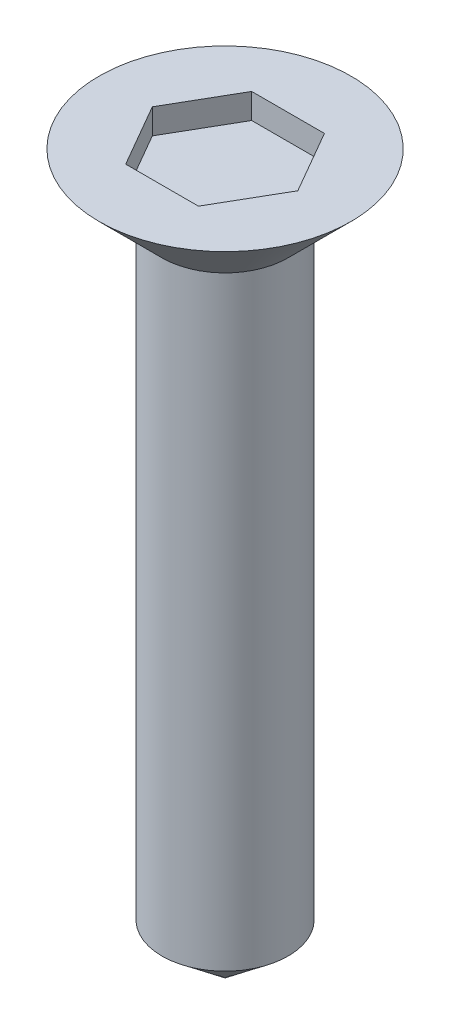
ISO-10303-21;
HEADER;
FILE_DESCRIPTION(('STEP AP214'),'2;1');
FILE_NAME('part.step','',(''),(''),'','','');
FILE_SCHEMA(('AUTOMOTIVE_DESIGN { 1 0 10303 214 1 1 1 1 }'));
ENDSEC;
DATA;
#1=APPLICATION_CONTEXT('core data for automotive mechanical design processes');
#2=APPLICATION_PROTOCOL_DEFINITION('international standard','automotive_design',2000,#1);
#3=PRODUCT_CONTEXT('',#1,'mechanical');
#4=PRODUCT('Part','Part','',(#3));
#5=PRODUCT_RELATED_PRODUCT_CATEGORY('part','',(#4));
#6=PRODUCT_DEFINITION_FORMATION('','',#4);
#7=PRODUCT_DEFINITION_CONTEXT('part definition',#1,'design');
#8=PRODUCT_DEFINITION('design','',#6,#7);
#9=PRODUCT_DEFINITION_SHAPE('','',#8);
#10=(LENGTH_UNIT() NAMED_UNIT(*) SI_UNIT(.MILLI.,.METRE.));
#11=(NAMED_UNIT(*) PLANE_ANGLE_UNIT() SI_UNIT($,.RADIAN.));
#12=(NAMED_UNIT(*) SI_UNIT($,.STERADIAN.) SOLID_ANGLE_UNIT());
#13=UNCERTAINTY_MEASURE_WITH_UNIT(LENGTH_MEASURE(1.E-05),#10,'distance_accuracy_value','');
#14=(GEOMETRIC_REPRESENTATION_CONTEXT(3) GLOBAL_UNCERTAINTY_ASSIGNED_CONTEXT((#13)) GLOBAL_UNIT_ASSIGNED_CONTEXT((#10,
#11,#12)) REPRESENTATION_CONTEXT('',''));
#15=CARTESIAN_POINT('',(0.,0.,0.));
#16=DIRECTION('',(0.,0.,1.));
#17=DIRECTION('',(1.,0.,0.));
#18=AXIS2_PLACEMENT_3D('',#15,#16,#17);
#19=CARTESIAN_POINT('',(0.,12.,0.));
#20=DIRECTION('',(0.,-1.,0.));
#21=DIRECTION('',(0.,0.,-1.));
#22=AXIS2_PLACEMENT_3D('',#19,#20,#21);
#23=CYLINDRICAL_SURFACE('',#22,1.25);
#24=CARTESIAN_POINT('',(0.,12.,0.));
#25=DIRECTION('',(0.,1.,0.));
#26=DIRECTION('',(0.,0.,1.));
#27=AXIS2_PLACEMENT_3D('',#24,#25,#26);
#28=CIRCLE('',#27,1.25);
#29=CARTESIAN_POINT('',(0.,12.,1.25));
#30=VERTEX_POINT('',#29);
#31=EDGE_CURVE('E11',#30,#30,#28,.T.);
#32=ORIENTED_EDGE('',*,*,#31,.F.);
#33=EDGE_LOOP('',(#32));
#34=FACE_BOUND('',#33,.T.);
#35=CARTESIAN_POINT('',(0.,0.,0.));
#36=DIRECTION('',(0.,1.,0.));
#37=DIRECTION('',(0.,0.,1.));
#38=AXIS2_PLACEMENT_3D('',#35,#36,#37);
#39=CIRCLE('',#38,1.25);
#40=CARTESIAN_POINT('',(0.,0.,1.25));
#41=VERTEX_POINT('',#40);
#42=EDGE_CURVE('E145',#41,#41,#39,.T.);
#43=ORIENTED_EDGE('',*,*,#42,.T.);
#44=EDGE_LOOP('',(#43));
#45=FACE_BOUND('',#44,.T.);
#46=ADVANCED_FACE('F47',(#34,#45),#23,.T.);
#47=CARTESIAN_POINT('',(0.,13.25,0.));
#48=DIRECTION('',(0.,-1.,0.));
#49=DIRECTION('',(0.,0.,-1.));
#50=AXIS2_PLACEMENT_3D('',#47,#48,#49);
#51=PLANE('',#50);
#52=DIRECTION('',(-0.5,0.,-0.866025403784439));
#53=VECTOR('',#52,1.);
#54=CARTESIAN_POINT('',(1.44337567297406,13.25,0.));
#55=LINE('',#54,#53);
#56=CARTESIAN_POINT('',(1.44337567297406,13.25,0.));
#57=VERTEX_POINT('',#56);
#58=CARTESIAN_POINT('',(0.721687836487032,13.25,-1.25));
#59=VERTEX_POINT('',#58);
#60=EDGE_CURVE('E144',#57,#59,#55,.T.);
#61=ORIENTED_EDGE('',*,*,#60,.F.);
#62=DIRECTION('',(0.5,0.,-0.866025403784439));
#63=VECTOR('',#62,1.);
#64=CARTESIAN_POINT('',(0.721687836487032,13.25,1.25));
#65=LINE('',#64,#63);
#66=CARTESIAN_POINT('',(0.721687836487032,13.25,1.25));
#67=VERTEX_POINT('',#66);
#68=EDGE_CURVE('E62',#67,#57,#65,.T.);
#69=ORIENTED_EDGE('',*,*,#68,.F.);
#70=DIRECTION('',(1.,0.,0.));
#71=VECTOR('',#70,1.);
#72=CARTESIAN_POINT('',(-0.721687836487033,13.25,1.25));
#73=LINE('',#72,#71);
#74=CARTESIAN_POINT('',(-0.721687836487033,13.25,1.25));
#75=VERTEX_POINT('',#74);
#76=EDGE_CURVE('E158',#75,#67,#73,.T.);
#77=ORIENTED_EDGE('',*,*,#76,.F.);
#78=DIRECTION('',(0.5,0.,0.866025403784439));
#79=VECTOR('',#78,1.);
#80=CARTESIAN_POINT('',(-1.44337567297407,13.25,0.));
#81=LINE('',#80,#79);
#82=CARTESIAN_POINT('',(-1.44337567297407,13.25,0.));
#83=VERTEX_POINT('',#82);
#84=EDGE_CURVE('E155',#83,#75,#81,.T.);
#85=ORIENTED_EDGE('',*,*,#84,.F.);
#86=DIRECTION('',(-0.5,0.,0.866025403784439));
#87=VECTOR('',#86,1.);
#88=CARTESIAN_POINT('',(-0.721687836487032,13.25,-1.25));
#89=LINE('',#88,#87);
#90=CARTESIAN_POINT('',(-0.721687836487032,13.25,-1.25));
#91=VERTEX_POINT('',#90);
#92=EDGE_CURVE('E112',#91,#83,#89,.T.);
#93=ORIENTED_EDGE('',*,*,#92,.F.);
#94=DIRECTION('',(-1.,0.,0.));
#95=VECTOR('',#94,1.);
#96=CARTESIAN_POINT('',(0.721687836487032,13.25,-1.25));
#97=LINE('',#96,#95);
#98=EDGE_CURVE('E149',#59,#91,#97,.T.);
#99=ORIENTED_EDGE('',*,*,#98,.F.);
#100=EDGE_LOOP('',(#61,#69,#77,#85,#93,#99));
#101=FACE_BOUND('',#100,.T.);
#102=CARTESIAN_POINT('',(0.,13.25,0.));
#103=DIRECTION('',(0.,1.,0.));
#104=DIRECTION('',(0.,0.,1.));
#105=AXIS2_PLACEMENT_3D('',#102,#103,#104);
#106=CIRCLE('',#105,2.5);
#107=CARTESIAN_POINT('',(0.,13.25,2.5));
#108=VERTEX_POINT('',#107);
#109=EDGE_CURVE('E55',#108,#108,#106,.T.);
#110=ORIENTED_EDGE('',*,*,#109,.T.);
#111=EDGE_LOOP('',(#110));
#112=FACE_BOUND('',#111,.T.);
#113=ADVANCED_FACE('F176',(#101,#112),#51,.F.);
#114=CARTESIAN_POINT('',(0.,12.,0.));
#115=DIRECTION('',(0.,1.,0.));
#116=DIRECTION('',(0.,0.,1.));
#117=AXIS2_PLACEMENT_3D('',#114,#115,#116);
#118=CONICAL_SURFACE('',#117,1.25,0.785398163397447);
#119=ORIENTED_EDGE('',*,*,#109,.F.);
#120=EDGE_LOOP('',(#119));
#121=FACE_BOUND('',#120,.T.);
#122=ORIENTED_EDGE('',*,*,#31,.T.);
#123=EDGE_LOOP('',(#122));
#124=FACE_BOUND('',#123,.T.);
#125=ADVANCED_FACE('F178',(#121,#124),#118,.T.);
#126=CARTESIAN_POINT('',(0.721687836487032,12.75,1.25));
#127=DIRECTION('',(0.866025403784439,0.,0.5));
#128=DIRECTION('',(0.5,0.,-0.866025403784439));
#129=AXIS2_PLACEMENT_3D('',#126,#127,#128);
#130=PLANE('',#129);
#131=ORIENTED_EDGE('',*,*,#68,.T.);
#132=DIRECTION('',(0.,1.,0.));
#133=VECTOR('',#132,1.);
#134=CARTESIAN_POINT('',(1.44337567297406,12.75,0.));
#135=LINE('',#134,#133);
#136=CARTESIAN_POINT('',(1.44337567297406,12.75,0.));
#137=VERTEX_POINT('',#136);
#138=EDGE_CURVE('E93',#137,#57,#135,.T.);
#139=ORIENTED_EDGE('',*,*,#138,.F.);
#140=DIRECTION('',(0.5,0.,-0.866025403784439));
#141=VECTOR('',#140,1.);
#142=CARTESIAN_POINT('',(0.721687836487032,12.75,1.25));
#143=LINE('',#142,#141);
#144=CARTESIAN_POINT('',(0.721687836487032,12.75,1.25));
#145=VERTEX_POINT('',#144);
#146=EDGE_CURVE('E161',#145,#137,#143,.T.);
#147=ORIENTED_EDGE('',*,*,#146,.F.);
#148=DIRECTION('',(0.,1.,0.));
#149=VECTOR('',#148,1.);
#150=CARTESIAN_POINT('',(0.721687836487032,12.75,1.25));
#151=LINE('',#150,#149);
#152=EDGE_CURVE('E70',#145,#67,#151,.T.);
#153=ORIENTED_EDGE('',*,*,#152,.T.);
#154=EDGE_LOOP('',(#131,#139,#147,#153));
#155=FACE_BOUND('',#154,.T.);
#156=ADVANCED_FACE('F181',(#155),#130,.F.);
#157=CARTESIAN_POINT('',(-0.721687836487033,12.75,1.25));
#158=DIRECTION('',(0.,0.,1.));
#159=DIRECTION('',(1.,0.,0.));
#160=AXIS2_PLACEMENT_3D('',#157,#158,#159);
#161=PLANE('',#160);
#162=ORIENTED_EDGE('',*,*,#76,.T.);
#163=ORIENTED_EDGE('',*,*,#152,.F.);
#164=DIRECTION('',(1.,0.,0.));
#165=VECTOR('',#164,1.);
#166=CARTESIAN_POINT('',(-0.721687836487033,12.75,1.25));
#167=LINE('',#166,#165);
#168=CARTESIAN_POINT('',(-0.721687836487033,12.75,1.25));
#169=VERTEX_POINT('',#168);
#170=EDGE_CURVE('E126',#169,#145,#167,.T.);
#171=ORIENTED_EDGE('',*,*,#170,.F.);
#172=DIRECTION('',(0.,1.,0.));
#173=VECTOR('',#172,1.);
#174=CARTESIAN_POINT('',(-0.721687836487033,12.75,1.25));
#175=LINE('',#174,#173);
#176=EDGE_CURVE('E117',#169,#75,#175,.T.);
#177=ORIENTED_EDGE('',*,*,#176,.T.);
#178=EDGE_LOOP('',(#162,#163,#171,#177));
#179=FACE_BOUND('',#178,.T.);
#180=ADVANCED_FACE('F203',(#179),#161,.F.);
#181=CARTESIAN_POINT('',(-1.44337567297407,12.75,0.));
#182=DIRECTION('',(-0.866025403784439,0.,0.5));
#183=DIRECTION('',(0.5,0.,0.866025403784439));
#184=AXIS2_PLACEMENT_3D('',#181,#182,#183);
#185=PLANE('',#184);
#186=ORIENTED_EDGE('',*,*,#84,.T.);
#187=ORIENTED_EDGE('',*,*,#176,.F.);
#188=DIRECTION('',(0.5,0.,0.866025403784439));
#189=VECTOR('',#188,1.);
#190=CARTESIAN_POINT('',(-1.44337567297407,12.75,0.));
#191=LINE('',#190,#189);
#192=CARTESIAN_POINT('',(-1.44337567297407,12.75,0.));
#193=VERTEX_POINT('',#192);
#194=EDGE_CURVE('E121',#193,#169,#191,.T.);
#195=ORIENTED_EDGE('',*,*,#194,.F.);
#196=DIRECTION('',(0.,1.,0.));
#197=VECTOR('',#196,1.);
#198=CARTESIAN_POINT('',(-1.44337567297407,12.75,0.));
#199=LINE('',#198,#197);
#200=EDGE_CURVE('E105',#193,#83,#199,.T.);
#201=ORIENTED_EDGE('',*,*,#200,.T.);
#202=EDGE_LOOP('',(#186,#187,#195,#201));
#203=FACE_BOUND('',#202,.T.);
#204=ADVANCED_FACE('F122',(#203),#185,.F.);
#205=CARTESIAN_POINT('',(-0.721687836487032,12.75,-1.25));
#206=DIRECTION('',(-0.866025403784438,0.,-0.5));
#207=DIRECTION('',(-0.5,0.,0.866025403784439));
#208=AXIS2_PLACEMENT_3D('',#205,#206,#207);
#209=PLANE('',#208);
#210=ORIENTED_EDGE('',*,*,#92,.T.);
#211=ORIENTED_EDGE('',*,*,#200,.F.);
#212=DIRECTION('',(-0.5,0.,0.866025403784439));
#213=VECTOR('',#212,1.);
#214=CARTESIAN_POINT('',(-0.721687836487032,12.75,-1.25));
#215=LINE('',#214,#213);
#216=CARTESIAN_POINT('',(-0.721687836487032,12.75,-1.25));
#217=VERTEX_POINT('',#216);
#218=EDGE_CURVE('E109',#217,#193,#215,.T.);
#219=ORIENTED_EDGE('',*,*,#218,.F.);
#220=DIRECTION('',(0.,1.,0.));
#221=VECTOR('',#220,1.);
#222=CARTESIAN_POINT('',(-0.721687836487032,12.75,-1.25));
#223=LINE('',#222,#221);
#224=EDGE_CURVE('E118',#217,#91,#223,.T.);
#225=ORIENTED_EDGE('',*,*,#224,.T.);
#226=EDGE_LOOP('',(#210,#211,#219,#225));
#227=FACE_BOUND('',#226,.T.);
#228=ADVANCED_FACE('F107',(#227),#209,.F.);
#229=CARTESIAN_POINT('',(0.721687836487032,12.75,-1.25));
#230=DIRECTION('',(0.,0.,-1.));
#231=DIRECTION('',(-1.,0.,0.));
#232=AXIS2_PLACEMENT_3D('',#229,#230,#231);
#233=PLANE('',#232);
#234=ORIENTED_EDGE('',*,*,#98,.T.);
#235=ORIENTED_EDGE('',*,*,#224,.F.);
#236=DIRECTION('',(-1.,0.,0.));
#237=VECTOR('',#236,1.);
#238=CARTESIAN_POINT('',(0.721687836487032,12.75,-1.25));
#239=LINE('',#238,#237);
#240=CARTESIAN_POINT('',(0.721687836487032,12.75,-1.25));
#241=VERTEX_POINT('',#240);
#242=EDGE_CURVE('E132',#241,#217,#239,.T.);
#243=ORIENTED_EDGE('',*,*,#242,.F.);
#244=DIRECTION('',(0.,1.,0.));
#245=VECTOR('',#244,1.);
#246=CARTESIAN_POINT('',(0.721687836487032,12.75,-1.25));
#247=LINE('',#246,#245);
#248=EDGE_CURVE('E168',#241,#59,#247,.T.);
#249=ORIENTED_EDGE('',*,*,#248,.T.);
#250=EDGE_LOOP('',(#234,#235,#243,#249));
#251=FACE_BOUND('',#250,.T.);
#252=ADVANCED_FACE('F200',(#251),#233,.F.);
#253=CARTESIAN_POINT('',(1.44337567297406,12.75,0.));
#254=DIRECTION('',(0.866025403784439,0.,-0.5));
#255=DIRECTION('',(-0.5,0.,-0.866025403784439));
#256=AXIS2_PLACEMENT_3D('',#253,#254,#255);
#257=PLANE('',#256);
#258=ORIENTED_EDGE('',*,*,#60,.T.);
#259=ORIENTED_EDGE('',*,*,#248,.F.);
#260=DIRECTION('',(-0.5,0.,-0.866025403784439));
#261=VECTOR('',#260,1.);
#262=CARTESIAN_POINT('',(1.44337567297406,12.75,0.));
#263=LINE('',#262,#261);
#264=EDGE_CURVE('E136',#137,#241,#263,.T.);
#265=ORIENTED_EDGE('',*,*,#264,.F.);
#266=ORIENTED_EDGE('',*,*,#138,.T.);
#267=EDGE_LOOP('',(#258,#259,#265,#266));
#268=FACE_BOUND('',#267,.T.);
#269=ADVANCED_FACE('F196',(#268),#257,.F.);
#270=CARTESIAN_POINT('',(0.,12.75,0.));
#271=DIRECTION('',(0.,1.,0.));
#272=DIRECTION('',(0.,0.,1.));
#273=AXIS2_PLACEMENT_3D('',#270,#271,#272);
#274=PLANE('',#273);
#275=ORIENTED_EDGE('',*,*,#146,.T.);
#276=ORIENTED_EDGE('',*,*,#264,.T.);
#277=ORIENTED_EDGE('',*,*,#242,.T.);
#278=ORIENTED_EDGE('',*,*,#218,.T.);
#279=ORIENTED_EDGE('',*,*,#194,.T.);
#280=ORIENTED_EDGE('',*,*,#170,.T.);
#281=EDGE_LOOP('',(#275,#276,#277,#278,#279,#280));
#282=FACE_BOUND('',#281,.T.);
#283=ADVANCED_FACE('F129',(#282),#274,.T.);
#284=CARTESIAN_POINT('',(0.,0.,0.));
#285=DIRECTION('',(0.,1.,0.));
#286=DIRECTION('',(0.,0.,1.));
#287=AXIS2_PLACEMENT_3D('',#284,#285,#286);
#288=CONICAL_SURFACE('',#287,1.25,0.896055384571344);
#289=CARTESIAN_POINT('',(0.,-1.,0.));
#290=VERTEX_POINT('',#289);
#291=VERTEX_LOOP('',#290);
#292=FACE_BOUND('',#291,.T.);
#293=ORIENTED_EDGE('',*,*,#42,.F.);
#294=EDGE_LOOP('',(#293));
#295=FACE_BOUND('',#294,.T.);
#296=ADVANCED_FACE('F272',(#292,#295),#288,.T.);
#297=CLOSED_SHELL('',(#46,#113,#125,#156,#180,#204,#228,#252,#269,#283,#296));
#298=MANIFOLD_SOLID_BREP('B2',#297);
#299=ADVANCED_BREP_SHAPE_REPRESENTATION('',(#18,#298),#14);
#300=SHAPE_DEFINITION_REPRESENTATION(#9,#299);
ENDSEC;
END-ISO-10303-21;
